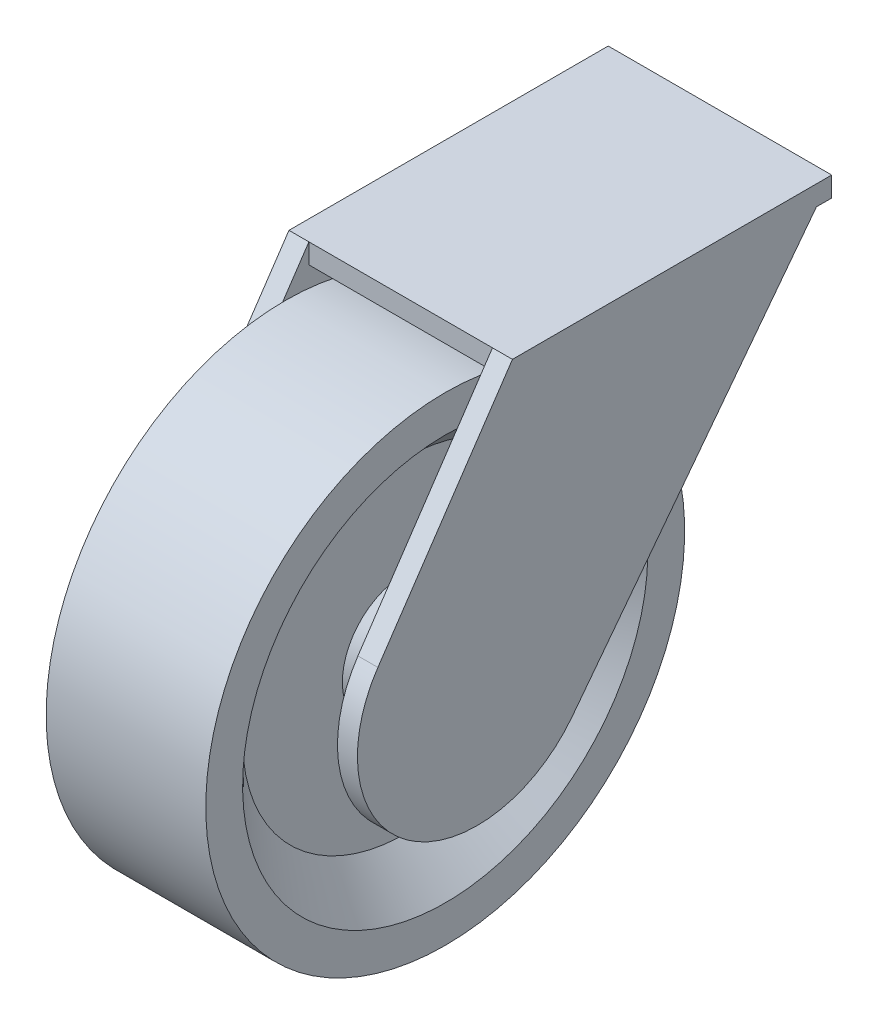
ISO-10303-21;
HEADER;
FILE_DESCRIPTION(('STEP AP214'),'2;1');
FILE_NAME('part.step','',(''),(''),'','','');
FILE_SCHEMA(('AUTOMOTIVE_DESIGN { 1 0 10303 214 1 1 1 1 }'));
ENDSEC;
DATA;
#1=APPLICATION_CONTEXT('core data for automotive mechanical design processes');
#2=APPLICATION_PROTOCOL_DEFINITION('international standard','automotive_design',2000,#1);
#3=PRODUCT_CONTEXT('',#1,'mechanical');
#4=PRODUCT('Part','Part','',(#3));
#5=PRODUCT_RELATED_PRODUCT_CATEGORY('part','',(#4));
#6=PRODUCT_DEFINITION_FORMATION('','',#4);
#7=PRODUCT_DEFINITION_CONTEXT('part definition',#1,'design');
#8=PRODUCT_DEFINITION('design','',#6,#7);
#9=PRODUCT_DEFINITION_SHAPE('','',#8);
#10=(LENGTH_UNIT() NAMED_UNIT(*) SI_UNIT(.MILLI.,.METRE.));
#11=(NAMED_UNIT(*) PLANE_ANGLE_UNIT() SI_UNIT($,.RADIAN.));
#12=(NAMED_UNIT(*) SI_UNIT($,.STERADIAN.) SOLID_ANGLE_UNIT());
#13=UNCERTAINTY_MEASURE_WITH_UNIT(LENGTH_MEASURE(1.E-05),#10,'distance_accuracy_value','');
#14=(GEOMETRIC_REPRESENTATION_CONTEXT(3) GLOBAL_UNCERTAINTY_ASSIGNED_CONTEXT((#13)) GLOBAL_UNIT_ASSIGNED_CONTEXT((#10,
#11,#12)) REPRESENTATION_CONTEXT('',''));
#15=CARTESIAN_POINT('',(0.,0.,0.));
#16=DIRECTION('',(0.,0.,1.));
#17=DIRECTION('',(1.,0.,0.));
#18=AXIS2_PLACEMENT_3D('',#15,#16,#17);
#19=CARTESIAN_POINT('',(-8.5,36.6834188281008,-47.0985325445976));
#20=DIRECTION('',(0.,-0.607552677878739,-0.794279386363749));
#21=DIRECTION('',(0.,0.794279386363749,-0.607552677878739));
#22=AXIS2_PLACEMENT_3D('',#19,#20,#21);
#23=PLANE('',#22);
#24=DIRECTION('',(0.,0.794279386363749,-0.607552677878739));
#25=VECTOR('',#24,1.);
#26=CARTESIAN_POINT('',(-8.5,36.6834188281008,-47.0985325445976));
#27=LINE('',#26,#25);
#28=CARTESIAN_POINT('',(-8.5,-5.81658117189922,-14.5898344049464));
#29=VERTEX_POINT('',#28);
#30=CARTESIAN_POINT('',(-8.5,34.1834188281008,-45.1862561834416));
#31=VERTEX_POINT('',#30);
#32=EDGE_CURVE('E234',#29,#31,#27,.T.);
#33=ORIENTED_EDGE('',*,*,#32,.T.);
#34=DIRECTION('',(1.,0.,0.));
#35=VECTOR('',#34,1.);
#36=CARTESIAN_POINT('',(-8.5,34.1834188281008,-45.1862561834416));
#37=LINE('',#36,#35);
#38=CARTESIAN_POINT('',(-6.,34.1834188281008,-45.1862561834416));
#39=VERTEX_POINT('',#38);
#40=EDGE_CURVE('E175',#31,#39,#37,.T.);
#41=ORIENTED_EDGE('',*,*,#40,.T.);
#42=DIRECTION('',(0.,0.794279386363749,-0.607552677878739));
#43=VECTOR('',#42,1.);
#44=CARTESIAN_POINT('',(-6.,36.6834188281008,-47.0985325445976));
#45=LINE('',#44,#43);
#46=CARTESIAN_POINT('',(-6.,-5.81658117189922,-14.5898344049464));
#47=VERTEX_POINT('',#46);
#48=EDGE_CURVE('E137',#47,#39,#45,.T.);
#49=ORIENTED_EDGE('',*,*,#48,.F.);
#50=DIRECTION('',(1.,0.,0.));
#51=VECTOR('',#50,1.);
#52=CARTESIAN_POINT('',(-8.5,-5.81658117189922,-14.5898344049464));
#53=LINE('',#52,#51);
#54=EDGE_CURVE('E255',#29,#47,#53,.T.);
#55=ORIENTED_EDGE('',*,*,#54,.F.);
#56=EDGE_LOOP('',(#33,#41,#49,#55));
#57=FACE_BOUND('',#56,.T.);
#58=ADVANCED_FACE('F44',(#57),#23,.T.);
#59=CARTESIAN_POINT('',(-31.5,36.6834188281008,-47.0985325445976));
#60=DIRECTION('',(0.,0.607552677878739,0.794279386363749));
#61=DIRECTION('',(0.,-0.794279386363749,0.607552677878739));
#62=AXIS2_PLACEMENT_3D('',#59,#60,#61);
#63=PLANE('',#62);
#64=DIRECTION('',(-1.,0.,0.));
#65=VECTOR('',#64,1.);
#66=CARTESIAN_POINT('',(-31.5,34.1834188281008,-45.1862561834416));
#67=LINE('',#66,#65);
#68=CARTESIAN_POINT('',(-31.5,34.1834188281008,-45.1862561834416));
#69=VERTEX_POINT('',#68);
#70=CARTESIAN_POINT('',(-34.,34.1834188281008,-45.1862561834416));
#71=VERTEX_POINT('',#70);
#72=EDGE_CURVE('E68',#69,#71,#67,.T.);
#73=ORIENTED_EDGE('',*,*,#72,.F.);
#74=DIRECTION('',(0.,0.794279386363749,-0.607552677878739));
#75=VECTOR('',#74,1.);
#76=CARTESIAN_POINT('',(-31.5,36.6834188281008,-47.0985325445976));
#77=LINE('',#76,#75);
#78=CARTESIAN_POINT('',(-31.5,-5.81658117189922,-14.5898344049464));
#79=VERTEX_POINT('',#78);
#80=EDGE_CURVE('E190',#79,#69,#77,.T.);
#81=ORIENTED_EDGE('',*,*,#80,.F.);
#82=DIRECTION('',(-1.,0.,0.));
#83=VECTOR('',#82,1.);
#84=CARTESIAN_POINT('',(-31.5,-5.81658117189922,-14.5898344049464));
#85=LINE('',#84,#83);
#86=CARTESIAN_POINT('',(-34.,-5.81658117189922,-14.5898344049464));
#87=VERTEX_POINT('',#86);
#88=EDGE_CURVE('E214',#79,#87,#85,.T.);
#89=ORIENTED_EDGE('',*,*,#88,.T.);
#90=DIRECTION('',(0.,0.794279386363749,-0.607552677878739));
#91=VECTOR('',#90,1.);
#92=CARTESIAN_POINT('',(-34.,36.6834188281008,-47.0985325445976));
#93=LINE('',#92,#91);
#94=EDGE_CURVE('E204',#87,#71,#93,.T.);
#95=ORIENTED_EDGE('',*,*,#94,.T.);
#96=EDGE_LOOP('',(#73,#81,#89,#95));
#97=FACE_BOUND('',#96,.T.);
#98=ADVANCED_FACE('F327',(#97),#63,.F.);
#99=CARTESIAN_POINT('',(-30.,33.2967089962819,-2.67564360949021));
#100=DIRECTION('',(-1.,0.,0.));
#101=DIRECTION('',(0.,-1.,0.));
#102=AXIS2_PLACEMENT_3D('',#99,#100,#101);
#103=PLANE('',#102);
#104=CARTESIAN_POINT('',(-30.,3.29670899628187,-2.67564360949021));
#105=DIRECTION('',(1.,0.,0.));
#106=DIRECTION('',(0.,1.,0.));
#107=AXIS2_PLACEMENT_3D('',#104,#105,#106);
#108=CIRCLE('',#107,25.3867513459481);
#109=CARTESIAN_POINT('',(-30.,28.68346034223,-2.67564360949021));
#110=VERTEX_POINT('',#109);
#111=EDGE_CURVE('E264',#110,#110,#108,.T.);
#112=ORIENTED_EDGE('',*,*,#111,.T.);
#113=EDGE_LOOP('',(#112));
#114=FACE_BOUND('',#113,.T.);
#115=CARTESIAN_POINT('',(-30.,3.29670899628187,-2.67564360949021));
#116=DIRECTION('',(1.,0.,0.));
#117=DIRECTION('',(0.,1.,0.));
#118=AXIS2_PLACEMENT_3D('',#115,#116,#117);
#119=CIRCLE('',#118,30.);
#120=CARTESIAN_POINT('',(-30.,33.2967089962819,-2.67564360949021));
#121=VERTEX_POINT('',#120);
#122=EDGE_CURVE('E263',#121,#121,#119,.T.);
#123=ORIENTED_EDGE('',*,*,#122,.F.);
#124=EDGE_LOOP('',(#123));
#125=FACE_BOUND('',#124,.T.);
#126=ADVANCED_FACE('F46',(#114,#125),#103,.T.);
#127=CARTESIAN_POINT('',(-10.,3.29670899628186,-2.67564360949021));
#128=DIRECTION('',(1.,0.,0.));
#129=DIRECTION('',(0.,1.,0.));
#130=AXIS2_PLACEMENT_3D('',#127,#128,#129);
#131=CYLINDRICAL_SURFACE('',#130,30.);
#132=ORIENTED_EDGE('',*,*,#122,.T.);
#133=EDGE_LOOP('',(#132));
#134=FACE_BOUND('',#133,.T.);
#135=CARTESIAN_POINT('',(-10.,3.29670899628186,-2.67564360949021));
#136=DIRECTION('',(1.,0.,0.));
#137=DIRECTION('',(0.,1.,0.));
#138=AXIS2_PLACEMENT_3D('',#135,#136,#137);
#139=CIRCLE('',#138,30.);
#140=CARTESIAN_POINT('',(-10.,33.2967089962819,-2.67564360949021));
#141=VERTEX_POINT('',#140);
#142=EDGE_CURVE('E296',#141,#141,#139,.T.);
#143=ORIENTED_EDGE('',*,*,#142,.F.);
#144=EDGE_LOOP('',(#143));
#145=FACE_BOUND('',#144,.T.);
#146=ADVANCED_FACE('F375',(#134,#145),#131,.T.);
#147=CARTESIAN_POINT('',(-10.,33.2967089962819,-2.67564360949021));
#148=DIRECTION('',(1.,0.,0.));
#149=DIRECTION('',(0.,1.,0.));
#150=AXIS2_PLACEMENT_3D('',#147,#148,#149);
#151=PLANE('',#150);
#152=ORIENTED_EDGE('',*,*,#142,.T.);
#153=EDGE_LOOP('',(#152));
#154=FACE_BOUND('',#153,.T.);
#155=CARTESIAN_POINT('',(-10.,3.29670899628186,-2.67564360949021));
#156=DIRECTION('',(1.,0.,0.));
#157=DIRECTION('',(0.,1.,0.));
#158=AXIS2_PLACEMENT_3D('',#155,#156,#157);
#159=CIRCLE('',#158,25.3867513459481);
#160=CARTESIAN_POINT('',(-10.,28.68346034223,-2.67564360949021));
#161=VERTEX_POINT('',#160);
#162=EDGE_CURVE('E292',#161,#161,#159,.T.);
#163=ORIENTED_EDGE('',*,*,#162,.F.);
#164=EDGE_LOOP('',(#163));
#165=FACE_BOUND('',#164,.T.);
#166=ADVANCED_FACE('F372',(#154,#165),#151,.T.);
#167=CARTESIAN_POINT('',(-15.,3.29670899628186,-2.67564360949021));
#168=DIRECTION('',(1.,0.,0.));
#169=DIRECTION('',(0.,1.,0.));
#170=AXIS2_PLACEMENT_3D('',#167,#168,#169);
#171=CONICAL_SURFACE('',#170,20.3867513459481,0.785398163397447);
#172=ORIENTED_EDGE('',*,*,#162,.T.);
#173=EDGE_LOOP('',(#172));
#174=FACE_BOUND('',#173,.T.);
#175=CARTESIAN_POINT('',(-15.,3.29670899628186,-2.67564360949021));
#176=DIRECTION('',(1.,0.,0.));
#177=DIRECTION('',(0.,1.,0.));
#178=AXIS2_PLACEMENT_3D('',#175,#176,#177);
#179=CIRCLE('',#178,20.3867513459481);
#180=CARTESIAN_POINT('',(-15.,23.68346034223,-2.67564360949021));
#181=VERTEX_POINT('',#180);
#182=EDGE_CURVE('E288',#181,#181,#179,.T.);
#183=ORIENTED_EDGE('',*,*,#182,.F.);
#184=EDGE_LOOP('',(#183));
#185=FACE_BOUND('',#184,.T.);
#186=ADVANCED_FACE('F368',(#174,#185),#171,.F.);
#187=CARTESIAN_POINT('',(-15.,23.68346034223,-2.67564360949021));
#188=DIRECTION('',(1.,0.,0.));
#189=DIRECTION('',(0.,1.,0.));
#190=AXIS2_PLACEMENT_3D('',#187,#188,#189);
#191=PLANE('',#190);
#192=ORIENTED_EDGE('',*,*,#182,.T.);
#193=EDGE_LOOP('',(#192));
#194=FACE_BOUND('',#193,.T.);
#195=CARTESIAN_POINT('',(-15.,3.29670899628186,-2.67564360949021));
#196=DIRECTION('',(1.,0.,0.));
#197=DIRECTION('',(0.,1.,0.));
#198=AXIS2_PLACEMENT_3D('',#195,#196,#197);
#199=CIRCLE('',#198,7.88675134594811);
#200=CARTESIAN_POINT('',(-15.,11.18346034223,-2.67564360949021));
#201=VERTEX_POINT('',#200);
#202=EDGE_CURVE('E284',#201,#201,#199,.T.);
#203=ORIENTED_EDGE('',*,*,#202,.F.);
#204=EDGE_LOOP('',(#203));
#205=FACE_BOUND('',#204,.T.);
#206=ADVANCED_FACE('F364',(#194,#205),#191,.T.);
#207=CARTESIAN_POINT('',(-10.,3.29670899628186,-2.67564360949021));
#208=DIRECTION('',(-1.,0.,0.));
#209=DIRECTION('',(0.,-1.,0.));
#210=AXIS2_PLACEMENT_3D('',#207,#208,#209);
#211=CONICAL_SURFACE('',#210,5.,0.523598775598296);
#212=ORIENTED_EDGE('',*,*,#202,.T.);
#213=EDGE_LOOP('',(#212));
#214=FACE_BOUND('',#213,.T.);
#215=CARTESIAN_POINT('',(-10.,3.29670899628186,-2.67564360949021));
#216=DIRECTION('',(1.,0.,0.));
#217=DIRECTION('',(0.,1.,0.));
#218=AXIS2_PLACEMENT_3D('',#215,#216,#217);
#219=CIRCLE('',#218,5.);
#220=CARTESIAN_POINT('',(-10.,8.29670899628186,-2.67564360949021));
#221=VERTEX_POINT('',#220);
#222=EDGE_CURVE('E280',#221,#221,#219,.T.);
#223=ORIENTED_EDGE('',*,*,#222,.F.);
#224=EDGE_LOOP('',(#223));
#225=FACE_BOUND('',#224,.T.);
#226=ADVANCED_FACE('F360',(#214,#225),#211,.T.);
#227=CARTESIAN_POINT('',(-10.,8.29670899628186,-2.67564360949021));
#228=DIRECTION('',(1.,0.,0.));
#229=DIRECTION('',(0.,1.,0.));
#230=AXIS2_PLACEMENT_3D('',#227,#228,#229);
#231=PLANE('',#230);
#232=CARTESIAN_POINT('',(-10.,3.29670899628186,-2.67564360949021));
#233=DIRECTION('',(1.,0.,0.));
#234=DIRECTION('',(0.,1.,0.));
#235=AXIS2_PLACEMENT_3D('',#232,#233,#234);
#236=CIRCLE('',#235,3.75);
#237=CARTESIAN_POINT('',(-10.,7.04670899628186,-2.67564360949021));
#238=VERTEX_POINT('',#237);
#239=EDGE_CURVE('E53',#238,#238,#236,.T.);
#240=ORIENTED_EDGE('',*,*,#239,.F.);
#241=EDGE_LOOP('',(#240));
#242=FACE_BOUND('',#241,.T.);
#243=ORIENTED_EDGE('',*,*,#222,.T.);
#244=EDGE_LOOP('',(#243));
#245=FACE_BOUND('',#244,.T.);
#246=ADVANCED_FACE('F356',(#242,#245),#231,.T.);
#247=CARTESIAN_POINT('',(-30.,8.29670899628186,-2.67564360949021));
#248=DIRECTION('',(-1.,0.,0.));
#249=DIRECTION('',(0.,-1.,0.));
#250=AXIS2_PLACEMENT_3D('',#247,#248,#249);
#251=PLANE('',#250);
#252=CARTESIAN_POINT('',(-30.,3.29670899628187,-2.67564360949021));
#253=DIRECTION('',(1.,0.,0.));
#254=DIRECTION('',(0.,1.,0.));
#255=AXIS2_PLACEMENT_3D('',#252,#253,#254);
#256=CIRCLE('',#255,3.75);
#257=CARTESIAN_POINT('',(-30.,7.04670899628187,-2.67564360949021));
#258=VERTEX_POINT('',#257);
#259=EDGE_CURVE('E213',#258,#258,#256,.T.);
#260=ORIENTED_EDGE('',*,*,#259,.T.);
#261=EDGE_LOOP('',(#260));
#262=FACE_BOUND('',#261,.T.);
#263=CARTESIAN_POINT('',(-30.,3.29670899628187,-2.67564360949021));
#264=DIRECTION('',(1.,0.,0.));
#265=DIRECTION('',(0.,1.,0.));
#266=AXIS2_PLACEMENT_3D('',#263,#264,#265);
#267=CIRCLE('',#266,5.);
#268=CARTESIAN_POINT('',(-30.,8.29670899628186,-2.67564360949021));
#269=VERTEX_POINT('',#268);
#270=EDGE_CURVE('E276',#269,#269,#267,.T.);
#271=ORIENTED_EDGE('',*,*,#270,.F.);
#272=EDGE_LOOP('',(#271));
#273=FACE_BOUND('',#272,.T.);
#274=ADVANCED_FACE('F352',(#262,#273),#251,.T.);
#275=CARTESIAN_POINT('',(-25.,3.29670899628187,-2.67564360949021));
#276=DIRECTION('',(1.,0.,0.));
#277=DIRECTION('',(0.,1.,0.));
#278=AXIS2_PLACEMENT_3D('',#275,#276,#277);
#279=CONICAL_SURFACE('',#278,7.88675134594811,0.523598775598296);
#280=ORIENTED_EDGE('',*,*,#270,.T.);
#281=EDGE_LOOP('',(#280));
#282=FACE_BOUND('',#281,.T.);
#283=CARTESIAN_POINT('',(-25.,3.29670899628187,-2.67564360949021));
#284=DIRECTION('',(1.,0.,0.));
#285=DIRECTION('',(0.,1.,0.));
#286=AXIS2_PLACEMENT_3D('',#283,#284,#285);
#287=CIRCLE('',#286,7.88675134594811);
#288=CARTESIAN_POINT('',(-25.,11.18346034223,-2.67564360949021));
#289=VERTEX_POINT('',#288);
#290=EDGE_CURVE('E272',#289,#289,#287,.T.);
#291=ORIENTED_EDGE('',*,*,#290,.F.);
#292=EDGE_LOOP('',(#291));
#293=FACE_BOUND('',#292,.T.);
#294=ADVANCED_FACE('F348',(#282,#293),#279,.T.);
#295=CARTESIAN_POINT('',(-25.,23.68346034223,-2.67564360949021));
#296=DIRECTION('',(-1.,0.,0.));
#297=DIRECTION('',(0.,-1.,0.));
#298=AXIS2_PLACEMENT_3D('',#295,#296,#297);
#299=PLANE('',#298);
#300=ORIENTED_EDGE('',*,*,#290,.T.);
#301=EDGE_LOOP('',(#300));
#302=FACE_BOUND('',#301,.T.);
#303=CARTESIAN_POINT('',(-25.,3.29670899628187,-2.67564360949021));
#304=DIRECTION('',(1.,0.,0.));
#305=DIRECTION('',(0.,1.,0.));
#306=AXIS2_PLACEMENT_3D('',#303,#304,#305);
#307=CIRCLE('',#306,20.3867513459481);
#308=CARTESIAN_POINT('',(-25.,23.68346034223,-2.67564360949021));
#309=VERTEX_POINT('',#308);
#310=EDGE_CURVE('E268',#309,#309,#307,.T.);
#311=ORIENTED_EDGE('',*,*,#310,.F.);
#312=EDGE_LOOP('',(#311));
#313=FACE_BOUND('',#312,.T.);
#314=ADVANCED_FACE('F344',(#302,#313),#299,.T.);
#315=CARTESIAN_POINT('',(-30.,3.29670899628187,-2.67564360949021));
#316=DIRECTION('',(-1.,0.,0.));
#317=DIRECTION('',(0.,-1.,0.));
#318=AXIS2_PLACEMENT_3D('',#315,#316,#317);
#319=CONICAL_SURFACE('',#318,25.3867513459481,0.785398163397447);
#320=ORIENTED_EDGE('',*,*,#310,.T.);
#321=EDGE_LOOP('',(#320));
#322=FACE_BOUND('',#321,.T.);
#323=ORIENTED_EDGE('',*,*,#111,.F.);
#324=EDGE_LOOP('',(#323));
#325=FACE_BOUND('',#324,.T.);
#326=ADVANCED_FACE('F341',(#322,#325),#319,.F.);
#327=CARTESIAN_POINT('',(-6.,3.29670899628186,-2.67564360949021));
#328=DIRECTION('',(-1.,0.,0.));
#329=DIRECTION('',(0.,-1.,0.));
#330=AXIS2_PLACEMENT_3D('',#327,#328,#329);
#331=CYLINDRICAL_SURFACE('',#330,3.75);
#332=CARTESIAN_POINT('',(-8.5,3.29670899628186,-2.67564360949021));
#333=DIRECTION('',(-1.,0.,0.));
#334=DIRECTION('',(0.,-1.,0.));
#335=AXIS2_PLACEMENT_3D('',#332,#333,#334);
#336=CIRCLE('',#335,3.75);
#337=CARTESIAN_POINT('',(-8.5,-0.453291003718136,-2.67564360949021));
#338=VERTEX_POINT('',#337);
#339=EDGE_CURVE('E252',#338,#338,#336,.T.);
#340=ORIENTED_EDGE('',*,*,#339,.T.);
#341=EDGE_LOOP('',(#340));
#342=FACE_BOUND('',#341,.T.);
#343=ORIENTED_EDGE('',*,*,#239,.T.);
#344=EDGE_LOOP('',(#343));
#345=FACE_BOUND('',#344,.T.);
#346=ADVANCED_FACE('F306',(#342,#345),#331,.T.);
#347=CARTESIAN_POINT('',(-8.5,11.6834188281008,9.76071832625578));
#348=DIRECTION('',(0.,0.559113988787928,0.8290907957164));
#349=DIRECTION('',(0.,-0.8290907957164,0.559113988787928));
#350=AXIS2_PLACEMENT_3D('',#347,#348,#349);
#351=PLANE('',#350);
#352=DIRECTION('',(0.,-0.8290907957164,0.559113988787928));
#353=VECTOR('',#352,1.);
#354=CARTESIAN_POINT('',(-6.,11.6834188281008,9.76071832625578));
#355=LINE('',#354,#353);
#356=CARTESIAN_POINT('',(-6.,36.6834188281008,-7.09853254459756));
#357=VERTEX_POINT('',#356);
#358=CARTESIAN_POINT('',(-6.,11.6834188281008,9.76071832625578));
#359=VERTEX_POINT('',#358);
#360=EDGE_CURVE('E224',#357,#359,#355,.T.);
#361=ORIENTED_EDGE('',*,*,#360,.F.);
#362=DIRECTION('',(1.,0.,0.));
#363=VECTOR('',#362,1.);
#364=CARTESIAN_POINT('',(-8.5,36.6834188281008,-7.09853254459756));
#365=LINE('',#364,#363);
#366=CARTESIAN_POINT('',(-8.5,36.6834188281008,-7.09853254459756));
#367=VERTEX_POINT('',#366);
#368=EDGE_CURVE('E249',#367,#357,#365,.T.);
#369=ORIENTED_EDGE('',*,*,#368,.F.);
#370=DIRECTION('',(0.,-0.8290907957164,0.559113988787928));
#371=VECTOR('',#370,1.);
#372=CARTESIAN_POINT('',(-8.5,11.6834188281008,9.76071832625578));
#373=LINE('',#372,#371);
#374=CARTESIAN_POINT('',(-8.5,11.6834188281008,9.76071832625578));
#375=VERTEX_POINT('',#374);
#376=EDGE_CURVE('E225',#367,#375,#373,.T.);
#377=ORIENTED_EDGE('',*,*,#376,.T.);
#378=DIRECTION('',(1.,0.,0.));
#379=VECTOR('',#378,1.);
#380=CARTESIAN_POINT('',(-8.5,11.6834188281008,9.76071832625578));
#381=LINE('',#380,#379);
#382=EDGE_CURVE('E238',#375,#359,#381,.T.);
#383=ORIENTED_EDGE('',*,*,#382,.T.);
#384=EDGE_LOOP('',(#361,#369,#377,#383));
#385=FACE_BOUND('',#384,.T.);
#386=ADVANCED_FACE('F335',(#385),#351,.T.);
#387=CARTESIAN_POINT('',(-8.5,36.6834188281008,-7.09853254459756));
#388=DIRECTION('',(0.,1.,0.));
#389=DIRECTION('',(-1.,0.,0.));
#390=AXIS2_PLACEMENT_3D('',#387,#388,#389);
#391=PLANE('',#390);
#392=DIRECTION('',(0.,0.,1.));
#393=VECTOR('',#392,1.);
#394=CARTESIAN_POINT('',(-6.,36.6834188281008,-7.09853254459756));
#395=LINE('',#394,#393);
#396=CARTESIAN_POINT('',(-6.,36.6834188281008,-47.0985325445976));
#397=VERTEX_POINT('',#396);
#398=EDGE_CURVE('E230',#397,#357,#395,.T.);
#399=ORIENTED_EDGE('',*,*,#398,.F.);
#400=DIRECTION('',(1.,0.,0.));
#401=VECTOR('',#400,1.);
#402=CARTESIAN_POINT('',(-8.5,36.6834188281008,-47.0985325445976));
#403=LINE('',#402,#401);
#404=CARTESIAN_POINT('',(-34.,36.6834188281008,-47.0985325445976));
#405=VERTEX_POINT('',#404);
#406=EDGE_CURVE('E149',#405,#397,#403,.T.);
#407=ORIENTED_EDGE('',*,*,#406,.F.);
#408=DIRECTION('',(0.,0.,1.));
#409=VECTOR('',#408,1.);
#410=CARTESIAN_POINT('',(-34.,36.6834188281008,-7.09853254459756));
#411=LINE('',#410,#409);
#412=CARTESIAN_POINT('',(-34.,36.6834188281008,-7.09853254459756));
#413=VERTEX_POINT('',#412);
#414=EDGE_CURVE('E201',#405,#413,#411,.T.);
#415=ORIENTED_EDGE('',*,*,#414,.T.);
#416=DIRECTION('',(-1.,0.,0.));
#417=VECTOR('',#416,1.);
#418=CARTESIAN_POINT('',(-31.5,36.6834188281008,-7.09853254459756));
#419=LINE('',#418,#417);
#420=CARTESIAN_POINT('',(-31.5,36.6834188281008,-7.09853254459756));
#421=VERTEX_POINT('',#420);
#422=EDGE_CURVE('E197',#421,#413,#419,.T.);
#423=ORIENTED_EDGE('',*,*,#422,.F.);
#424=DIRECTION('',(1.,0.,0.));
#425=VECTOR('',#424,1.);
#426=CARTESIAN_POINT('',(-34.,36.6834188281008,-7.09853254459756));
#427=LINE('',#426,#425);
#428=EDGE_CURVE('E162',#421,#367,#427,.T.);
#429=ORIENTED_EDGE('',*,*,#428,.T.);
#430=ORIENTED_EDGE('',*,*,#368,.T.);
#431=EDGE_LOOP('',(#399,#407,#415,#423,#429,#430));
#432=FACE_BOUND('',#431,.T.);
#433=ADVANCED_FACE('F320',(#432),#391,.T.);
#434=CARTESIAN_POINT('',(-8.5,3.29670899628186,-2.67564360949021));
#435=DIRECTION('',(1.,0.,0.));
#436=DIRECTION('',(0.,1.,0.));
#437=AXIS2_PLACEMENT_3D('',#434,#435,#436);
#438=CYLINDRICAL_SURFACE('',#437,15.);
#439=CARTESIAN_POINT('',(-6.,3.29670899628186,-2.67564360949021));
#440=DIRECTION('',(1.,0.,0.));
#441=DIRECTION('',(0.,-1.,0.));
#442=AXIS2_PLACEMENT_3D('',#439,#440,#441);
#443=CIRCLE('',#442,15.);
#444=EDGE_CURVE('E242',#359,#47,#443,.T.);
#445=ORIENTED_EDGE('',*,*,#444,.F.);
#446=ORIENTED_EDGE('',*,*,#382,.F.);
#447=CARTESIAN_POINT('',(-8.5,3.29670899628186,-2.67564360949021));
#448=DIRECTION('',(1.,0.,0.));
#449=DIRECTION('',(0.,-1.,0.));
#450=AXIS2_PLACEMENT_3D('',#447,#448,#449);
#451=CIRCLE('',#450,15.);
#452=EDGE_CURVE('E229',#375,#29,#451,.T.);
#453=ORIENTED_EDGE('',*,*,#452,.T.);
#454=ORIENTED_EDGE('',*,*,#54,.T.);
#455=EDGE_LOOP('',(#445,#446,#453,#454));
#456=FACE_BOUND('',#455,.T.);
#457=ADVANCED_FACE('F311',(#456),#438,.T.);
#458=CARTESIAN_POINT('',(-8.5,3.29670899628186,-2.67564360949021));
#459=DIRECTION('',(-1.,0.,0.));
#460=DIRECTION('',(0.,-1.,0.));
#461=AXIS2_PLACEMENT_3D('',#458,#459,#460);
#462=PLANE('',#461);
#463=DIRECTION('',(0.,1.,0.));
#464=VECTOR('',#463,1.);
#465=CARTESIAN_POINT('',(-8.5,3.29670899628186,-7.09853254459756));
#466=LINE('',#465,#464);
#467=CARTESIAN_POINT('',(-8.5,34.1834188281008,-7.09853254459756));
#468=VERTEX_POINT('',#467);
#469=EDGE_CURVE('E181',#468,#367,#466,.T.);
#470=ORIENTED_EDGE('',*,*,#469,.F.);
#471=DIRECTION('',(0.,0.,-1.));
#472=VECTOR('',#471,1.);
#473=CARTESIAN_POINT('',(-8.5,34.1834188281008,-2.67564360949021));
#474=LINE('',#473,#472);
#475=EDGE_CURVE('E171',#468,#31,#474,.T.);
#476=ORIENTED_EDGE('',*,*,#475,.T.);
#477=ORIENTED_EDGE('',*,*,#32,.F.);
#478=ORIENTED_EDGE('',*,*,#452,.F.);
#479=ORIENTED_EDGE('',*,*,#376,.F.);
#480=EDGE_LOOP('',(#470,#476,#477,#478,#479));
#481=FACE_BOUND('',#480,.T.);
#482=ORIENTED_EDGE('',*,*,#339,.F.);
#483=EDGE_LOOP('',(#482));
#484=FACE_BOUND('',#483,.T.);
#485=ADVANCED_FACE('F309',(#481,#484),#462,.T.);
#486=CARTESIAN_POINT('',(-6.,3.29670899628186,-2.67564360949021));
#487=DIRECTION('',(1.,0.,0.));
#488=DIRECTION('',(0.,1.,0.));
#489=AXIS2_PLACEMENT_3D('',#486,#487,#488);
#490=PLANE('',#489);
#491=ORIENTED_EDGE('',*,*,#398,.T.);
#492=ORIENTED_EDGE('',*,*,#360,.T.);
#493=ORIENTED_EDGE('',*,*,#444,.T.);
#494=ORIENTED_EDGE('',*,*,#48,.T.);
#495=DIRECTION('',(0.,0.,-1.));
#496=VECTOR('',#495,1.);
#497=CARTESIAN_POINT('',(-6.,34.1834188281008,-47.0985325445976));
#498=LINE('',#497,#496);
#499=CARTESIAN_POINT('',(-6.,34.1834188281008,-47.0985325445976));
#500=VERTEX_POINT('',#499);
#501=EDGE_CURVE('E129',#39,#500,#498,.T.);
#502=ORIENTED_EDGE('',*,*,#501,.T.);
#503=DIRECTION('',(0.,1.,0.));
#504=VECTOR('',#503,1.);
#505=CARTESIAN_POINT('',(-6.,34.1834188281008,-47.0985325445976));
#506=LINE('',#505,#504);
#507=EDGE_CURVE('E133',#500,#397,#506,.T.);
#508=ORIENTED_EDGE('',*,*,#507,.T.);
#509=EDGE_LOOP('',(#491,#492,#493,#494,#502,#508));
#510=FACE_BOUND('',#509,.T.);
#511=ADVANCED_FACE('F132',(#510),#490,.T.);
#512=CARTESIAN_POINT('',(-34.,3.29670899628187,-2.67564360949021));
#513=DIRECTION('',(1.,0.,0.));
#514=DIRECTION('',(0.,1.,0.));
#515=AXIS2_PLACEMENT_3D('',#512,#513,#514);
#516=CYLINDRICAL_SURFACE('',#515,3.75);
#517=CARTESIAN_POINT('',(-31.5,3.29670899628187,-2.67564360949021));
#518=DIRECTION('',(1.,0.,0.));
#519=DIRECTION('',(0.,1.,0.));
#520=AXIS2_PLACEMENT_3D('',#517,#518,#519);
#521=CIRCLE('',#520,3.75);
#522=CARTESIAN_POINT('',(-31.5,7.04670899628187,-2.67564360949021));
#523=VERTEX_POINT('',#522);
#524=EDGE_CURVE('E11',#523,#523,#521,.F.);
#525=ORIENTED_EDGE('',*,*,#524,.F.);
#526=EDGE_LOOP('',(#525));
#527=FACE_BOUND('',#526,.T.);
#528=ORIENTED_EDGE('',*,*,#259,.F.);
#529=EDGE_LOOP('',(#528));
#530=FACE_BOUND('',#529,.T.);
#531=ADVANCED_FACE('F318',(#527,#530),#516,.T.);
#532=CARTESIAN_POINT('',(-31.5,11.6834188281008,9.76071832625578));
#533=DIRECTION('',(0.,-0.559113988787928,-0.8290907957164));
#534=DIRECTION('',(0.,0.8290907957164,-0.559113988787928));
#535=AXIS2_PLACEMENT_3D('',#532,#533,#534);
#536=PLANE('',#535);
#537=DIRECTION('',(0.,-0.8290907957164,0.559113988787928));
#538=VECTOR('',#537,1.);
#539=CARTESIAN_POINT('',(-34.,11.6834188281008,9.76071832625578));
#540=LINE('',#539,#538);
#541=CARTESIAN_POINT('',(-34.,11.6834188281008,9.76071832625578));
#542=VERTEX_POINT('',#541);
#543=EDGE_CURVE('E185',#413,#542,#540,.T.);
#544=ORIENTED_EDGE('',*,*,#543,.T.);
#545=DIRECTION('',(-1.,0.,0.));
#546=VECTOR('',#545,1.);
#547=CARTESIAN_POINT('',(-31.5,11.6834188281008,9.76071832625578));
#548=LINE('',#547,#546);
#549=CARTESIAN_POINT('',(-31.5,11.6834188281008,9.76071832625578));
#550=VERTEX_POINT('',#549);
#551=EDGE_CURVE('E209',#550,#542,#548,.T.);
#552=ORIENTED_EDGE('',*,*,#551,.F.);
#553=DIRECTION('',(0.,-0.8290907957164,0.559113988787928));
#554=VECTOR('',#553,1.);
#555=CARTESIAN_POINT('',(-31.5,11.6834188281008,9.76071832625578));
#556=LINE('',#555,#554);
#557=EDGE_CURVE('E186',#421,#550,#556,.T.);
#558=ORIENTED_EDGE('',*,*,#557,.F.);
#559=ORIENTED_EDGE('',*,*,#422,.T.);
#560=EDGE_LOOP('',(#544,#552,#558,#559));
#561=FACE_BOUND('',#560,.T.);
#562=ADVANCED_FACE('F513',(#561),#536,.F.);
#563=CARTESIAN_POINT('',(-31.5,3.29670899628187,-2.67564360949021));
#564=DIRECTION('',(-1.,0.,0.));
#565=DIRECTION('',(0.,-1.,0.));
#566=AXIS2_PLACEMENT_3D('',#563,#564,#565);
#567=CYLINDRICAL_SURFACE('',#566,15.);
#568=CARTESIAN_POINT('',(-34.,3.29670899628187,-2.67564360949021));
#569=DIRECTION('',(1.,0.,0.));
#570=DIRECTION('',(0.,-1.,0.));
#571=AXIS2_PLACEMENT_3D('',#568,#569,#570);
#572=CIRCLE('',#571,15.);
#573=EDGE_CURVE('E191',#542,#87,#572,.T.);
#574=ORIENTED_EDGE('',*,*,#573,.T.);
#575=ORIENTED_EDGE('',*,*,#88,.F.);
#576=CARTESIAN_POINT('',(-31.5,3.29670899628187,-2.67564360949021));
#577=DIRECTION('',(1.,0.,0.));
#578=DIRECTION('',(0.,-1.,0.));
#579=AXIS2_PLACEMENT_3D('',#576,#577,#578);
#580=CIRCLE('',#579,15.);
#581=EDGE_CURVE('E194',#550,#79,#580,.T.);
#582=ORIENTED_EDGE('',*,*,#581,.F.);
#583=ORIENTED_EDGE('',*,*,#551,.T.);
#584=EDGE_LOOP('',(#574,#575,#582,#583));
#585=FACE_BOUND('',#584,.T.);
#586=ADVANCED_FACE('F504',(#585),#567,.T.);
#587=CARTESIAN_POINT('',(-31.5,3.29670899628187,-2.67564360949021));
#588=DIRECTION('',(1.,0.,0.));
#589=DIRECTION('',(0.,-1.,0.));
#590=AXIS2_PLACEMENT_3D('',#587,#588,#589);
#591=PLANE('',#590);
#592=DIRECTION('',(0.,-1.,0.));
#593=VECTOR('',#592,1.);
#594=CARTESIAN_POINT('',(-31.5,3.29670899628187,-7.09853254459756));
#595=LINE('',#594,#593);
#596=CARTESIAN_POINT('',(-31.5,34.1834188281008,-7.09853254459756));
#597=VERTEX_POINT('',#596);
#598=EDGE_CURVE('E178',#421,#597,#595,.T.);
#599=ORIENTED_EDGE('',*,*,#598,.F.);
#600=ORIENTED_EDGE('',*,*,#557,.T.);
#601=ORIENTED_EDGE('',*,*,#581,.T.);
#602=ORIENTED_EDGE('',*,*,#80,.T.);
#603=DIRECTION('',(0.,0.,1.));
#604=VECTOR('',#603,1.);
#605=CARTESIAN_POINT('',(-31.5,34.1834188281008,-2.67564360949021));
#606=LINE('',#605,#604);
#607=EDGE_CURVE('E60',#69,#597,#606,.T.);
#608=ORIENTED_EDGE('',*,*,#607,.T.);
#609=EDGE_LOOP('',(#599,#600,#601,#602,#608));
#610=FACE_BOUND('',#609,.T.);
#611=ORIENTED_EDGE('',*,*,#524,.T.);
#612=EDGE_LOOP('',(#611));
#613=FACE_BOUND('',#612,.T.);
#614=ADVANCED_FACE('F457',(#610,#613),#591,.T.);
#615=CARTESIAN_POINT('',(-34.,3.29670899628187,-2.67564360949021));
#616=DIRECTION('',(-1.,0.,0.));
#617=DIRECTION('',(0.,1.,0.));
#618=AXIS2_PLACEMENT_3D('',#615,#616,#617);
#619=PLANE('',#618);
#620=ORIENTED_EDGE('',*,*,#543,.F.);
#621=ORIENTED_EDGE('',*,*,#414,.F.);
#622=DIRECTION('',(0.,1.,0.));
#623=VECTOR('',#622,1.);
#624=CARTESIAN_POINT('',(-34.,34.1834188281008,-47.0985325445976));
#625=LINE('',#624,#623);
#626=CARTESIAN_POINT('',(-34.,34.1834188281008,-47.0985325445976));
#627=VERTEX_POINT('',#626);
#628=EDGE_CURVE('E152',#627,#405,#625,.T.);
#629=ORIENTED_EDGE('',*,*,#628,.F.);
#630=DIRECTION('',(0.,0.,1.));
#631=VECTOR('',#630,1.);
#632=CARTESIAN_POINT('',(-34.,34.1834188281008,-47.0985325445976));
#633=LINE('',#632,#631);
#634=EDGE_CURVE('E157',#627,#71,#633,.T.);
#635=ORIENTED_EDGE('',*,*,#634,.T.);
#636=ORIENTED_EDGE('',*,*,#94,.F.);
#637=ORIENTED_EDGE('',*,*,#573,.F.);
#638=EDGE_LOOP('',(#620,#621,#629,#635,#636,#637));
#639=FACE_BOUND('',#638,.T.);
#640=ADVANCED_FACE('F451',(#639),#619,.T.);
#641=CARTESIAN_POINT('',(-10.,34.1834188281008,-2.67564360949021));
#642=DIRECTION('',(0.,1.,0.));
#643=DIRECTION('',(0.,0.,1.));
#644=AXIS2_PLACEMENT_3D('',#641,#642,#643);
#645=PLANE('',#644);
#646=ORIENTED_EDGE('',*,*,#40,.F.);
#647=ORIENTED_EDGE('',*,*,#475,.F.);
#648=DIRECTION('',(1.,0.,0.));
#649=VECTOR('',#648,1.);
#650=CARTESIAN_POINT('',(-34.,34.1834188281008,-7.09853254459756));
#651=LINE('',#650,#649);
#652=EDGE_CURVE('E143',#597,#468,#651,.T.);
#653=ORIENTED_EDGE('',*,*,#652,.F.);
#654=ORIENTED_EDGE('',*,*,#607,.F.);
#655=ORIENTED_EDGE('',*,*,#72,.T.);
#656=ORIENTED_EDGE('',*,*,#634,.F.);
#657=DIRECTION('',(-1.,0.,0.));
#658=VECTOR('',#657,1.);
#659=CARTESIAN_POINT('',(-34.,34.1834188281008,-47.0985325445976));
#660=LINE('',#659,#658);
#661=EDGE_CURVE('E142',#500,#627,#660,.T.);
#662=ORIENTED_EDGE('',*,*,#661,.F.);
#663=ORIENTED_EDGE('',*,*,#501,.F.);
#664=EDGE_LOOP('',(#646,#647,#653,#654,#655,#656,#662,#663));
#665=FACE_BOUND('',#664,.T.);
#666=ADVANCED_FACE('F155',(#665),#645,.F.);
#667=CARTESIAN_POINT('',(-34.,34.1834188281008,-47.0985325445976));
#668=DIRECTION('',(0.,0.,-1.));
#669=DIRECTION('',(-1.,0.,0.));
#670=AXIS2_PLACEMENT_3D('',#667,#668,#669);
#671=PLANE('',#670);
#672=ORIENTED_EDGE('',*,*,#406,.T.);
#673=ORIENTED_EDGE('',*,*,#507,.F.);
#674=ORIENTED_EDGE('',*,*,#661,.T.);
#675=ORIENTED_EDGE('',*,*,#628,.T.);
#676=EDGE_LOOP('',(#672,#673,#674,#675));
#677=FACE_BOUND('',#676,.T.);
#678=ADVANCED_FACE('F147',(#677),#671,.T.);
#679=CARTESIAN_POINT('',(-34.,34.1834188281008,-7.09853254459756));
#680=DIRECTION('',(0.,0.,1.));
#681=DIRECTION('',(1.,0.,0.));
#682=AXIS2_PLACEMENT_3D('',#679,#680,#681);
#683=PLANE('',#682);
#684=ORIENTED_EDGE('',*,*,#652,.T.);
#685=ORIENTED_EDGE('',*,*,#469,.T.);
#686=ORIENTED_EDGE('',*,*,#428,.F.);
#687=ORIENTED_EDGE('',*,*,#598,.T.);
#688=EDGE_LOOP('',(#684,#685,#686,#687));
#689=FACE_BOUND('',#688,.T.);
#690=ADVANCED_FACE('F480',(#689),#683,.T.);
#691=CLOSED_SHELL('',(#58,#98,#126,#146,#166,#186,#206,#226,#246,#274,#294,#314,#326,#346,#386,
#433,#457,#485,#511,#531,#562,#586,#614,#640,#666,#678,#690));
#692=MANIFOLD_SOLID_BREP('B2',#691);
#693=ADVANCED_BREP_SHAPE_REPRESENTATION('',(#18,#692),#14);
#694=SHAPE_DEFINITION_REPRESENTATION(#9,#693);
ENDSEC;
END-ISO-10303-21;
